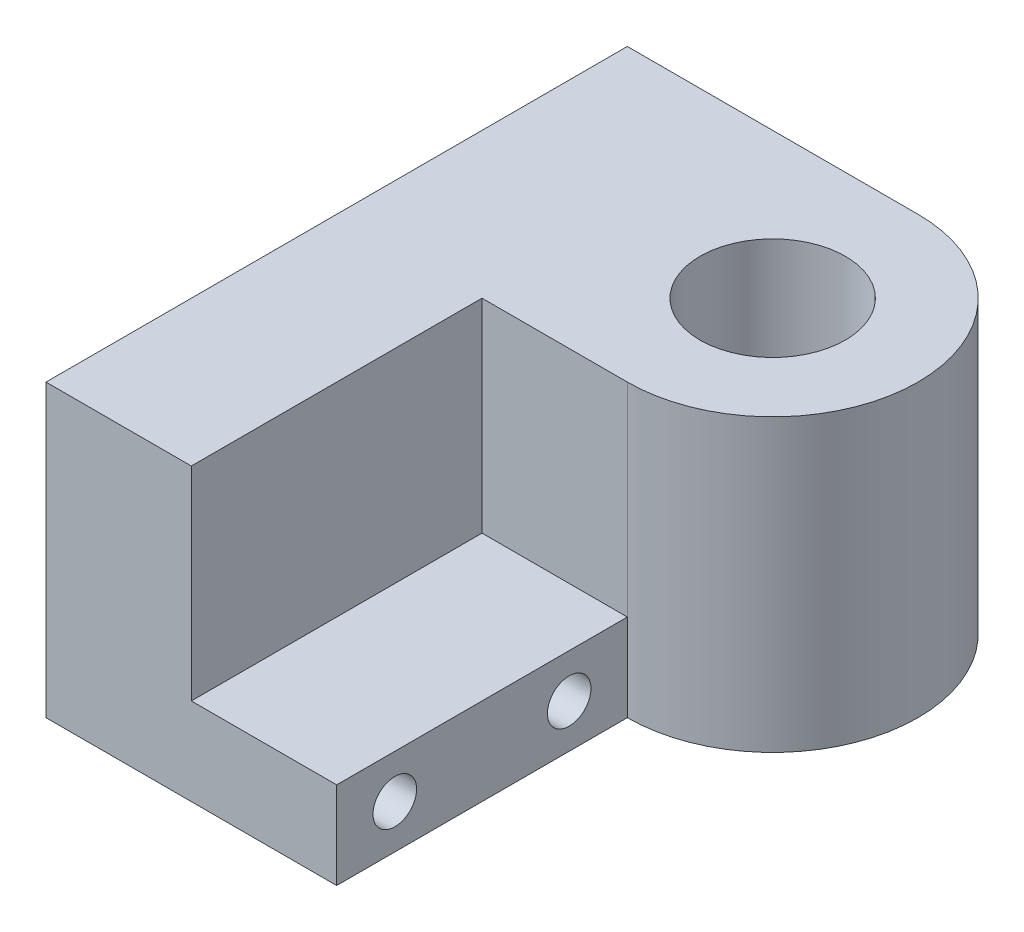
ISO-10303-21;
HEADER;
FILE_DESCRIPTION(('STEP AP214'),'2;1');
FILE_NAME('part.step','',(''),(''),'','','');
FILE_SCHEMA(('AUTOMOTIVE_DESIGN { 1 0 10303 214 1 1 1 1 }'));
ENDSEC;
DATA;
#1=APPLICATION_CONTEXT('core data for automotive mechanical design processes');
#2=APPLICATION_PROTOCOL_DEFINITION('international standard','automotive_design',2000,#1);
#3=PRODUCT_CONTEXT('',#1,'mechanical');
#4=PRODUCT('Part','Part','',(#3));
#5=PRODUCT_RELATED_PRODUCT_CATEGORY('part','',(#4));
#6=PRODUCT_DEFINITION_FORMATION('','',#4);
#7=PRODUCT_DEFINITION_CONTEXT('part definition',#1,'design');
#8=PRODUCT_DEFINITION('design','',#6,#7);
#9=PRODUCT_DEFINITION_SHAPE('','',#8);
#10=(LENGTH_UNIT() NAMED_UNIT(*) SI_UNIT(.MILLI.,.METRE.));
#11=(NAMED_UNIT(*) PLANE_ANGLE_UNIT() SI_UNIT($,.RADIAN.));
#12=(NAMED_UNIT(*) SI_UNIT($,.STERADIAN.) SOLID_ANGLE_UNIT());
#13=UNCERTAINTY_MEASURE_WITH_UNIT(LENGTH_MEASURE(1.E-05),#10,'distance_accuracy_value','');
#14=(GEOMETRIC_REPRESENTATION_CONTEXT(3) GLOBAL_UNCERTAINTY_ASSIGNED_CONTEXT((#13)) GLOBAL_UNIT_ASSIGNED_CONTEXT((#10,
#11,#12)) REPRESENTATION_CONTEXT('',''));
#15=CARTESIAN_POINT('',(0.,0.,0.));
#16=DIRECTION('',(0.,0.,1.));
#17=DIRECTION('',(1.,0.,0.));
#18=AXIS2_PLACEMENT_3D('',#15,#16,#17);
#19=CARTESIAN_POINT('',(0.,100.,50.));
#20=DIRECTION('',(0.,0.,1.));
#21=DIRECTION('',(1.,0.,0.));
#22=AXIS2_PLACEMENT_3D('',#19,#20,#21);
#23=PLANE('',#22);
#24=DIRECTION('',(-1.,0.,0.));
#25=VECTOR('',#24,1.);
#26=CARTESIAN_POINT('',(0.,30.,50.));
#27=LINE('',#26,#25);
#28=CARTESIAN_POINT('',(0.,30.,50.));
#29=VERTEX_POINT('',#28);
#30=CARTESIAN_POINT('',(-50.,30.,50.));
#31=VERTEX_POINT('',#30);
#32=EDGE_CURVE('E50',#29,#31,#27,.T.);
#33=ORIENTED_EDGE('',*,*,#32,.F.);
#34=DIRECTION('',(0.,-1.,0.));
#35=VECTOR('',#34,1.);
#36=CARTESIAN_POINT('',(0.,100.,50.));
#37=LINE('',#36,#35);
#38=CARTESIAN_POINT('',(0.,100.,50.));
#39=VERTEX_POINT('',#38);
#40=EDGE_CURVE('E11',#39,#29,#37,.T.);
#41=ORIENTED_EDGE('',*,*,#40,.F.);
#42=DIRECTION('',(-1.,0.,0.));
#43=VECTOR('',#42,1.);
#44=CARTESIAN_POINT('',(0.,100.,50.));
#45=LINE('',#44,#43);
#46=CARTESIAN_POINT('',(-50.,100.,50.));
#47=VERTEX_POINT('',#46);
#48=EDGE_CURVE('E132',#39,#47,#45,.T.);
#49=ORIENTED_EDGE('',*,*,#48,.T.);
#50=DIRECTION('',(0.,-1.,0.));
#51=VECTOR('',#50,1.);
#52=CARTESIAN_POINT('',(-50.,100.,50.));
#53=LINE('',#52,#51);
#54=EDGE_CURVE('E149',#47,#31,#53,.T.);
#55=ORIENTED_EDGE('',*,*,#54,.T.);
#56=EDGE_LOOP('',(#33,#41,#49,#55));
#57=FACE_BOUND('',#56,.T.);
#58=ADVANCED_FACE('F35',(#57),#23,.T.);
#59=CARTESIAN_POINT('',(0.,100.,0.));
#60=DIRECTION('',(0.,-1.,0.));
#61=DIRECTION('',(0.,0.,-1.));
#62=AXIS2_PLACEMENT_3D('',#59,#60,#61);
#63=CYLINDRICAL_SURFACE('',#62,50.);
#64=CARTESIAN_POINT('',(0.,0.,0.));
#65=DIRECTION('',(0.,1.,0.));
#66=DIRECTION('',(0.,0.,1.));
#67=AXIS2_PLACEMENT_3D('',#64,#65,#66);
#68=CIRCLE('',#67,50.);
#69=CARTESIAN_POINT('',(0.,0.,50.));
#70=VERTEX_POINT('',#69);
#71=CARTESIAN_POINT('',(0.,0.,-50.));
#72=VERTEX_POINT('',#71);
#73=EDGE_CURVE('E152',#70,#72,#68,.T.);
#74=ORIENTED_EDGE('',*,*,#73,.T.);
#75=DIRECTION('',(0.,-1.,0.));
#76=VECTOR('',#75,1.);
#77=CARTESIAN_POINT('',(0.,100.,-50.));
#78=LINE('',#77,#76);
#79=CARTESIAN_POINT('',(0.,100.,-50.));
#80=VERTEX_POINT('',#79);
#81=EDGE_CURVE('E43',#80,#72,#78,.T.);
#82=ORIENTED_EDGE('',*,*,#81,.F.);
#83=CARTESIAN_POINT('',(0.,100.,0.));
#84=DIRECTION('',(0.,1.,0.));
#85=DIRECTION('',(0.,0.,1.));
#86=AXIS2_PLACEMENT_3D('',#83,#84,#85);
#87=CIRCLE('',#86,50.);
#88=EDGE_CURVE('E135',#39,#80,#87,.T.);
#89=ORIENTED_EDGE('',*,*,#88,.F.);
#90=ORIENTED_EDGE('',*,*,#40,.T.);
#91=DIRECTION('',(0.,-1.,0.));
#92=VECTOR('',#91,1.);
#93=CARTESIAN_POINT('',(0.,30.,50.));
#94=LINE('',#93,#92);
#95=EDGE_CURVE('E114',#29,#70,#94,.T.);
#96=ORIENTED_EDGE('',*,*,#95,.T.);
#97=EDGE_LOOP('',(#74,#82,#89,#90,#96));
#98=FACE_BOUND('',#97,.T.);
#99=ADVANCED_FACE('F176',(#98),#63,.T.);
#100=CARTESIAN_POINT('',(0.,100.,-50.));
#101=DIRECTION('',(0.,0.,1.));
#102=DIRECTION('',(1.,0.,0.));
#103=AXIS2_PLACEMENT_3D('',#100,#101,#102);
#104=PLANE('',#103);
#105=DIRECTION('',(-1.,0.,0.));
#106=VECTOR('',#105,1.);
#107=CARTESIAN_POINT('',(0.,0.,-50.));
#108=LINE('',#107,#106);
#109=CARTESIAN_POINT('',(-100.,0.,-50.));
#110=VERTEX_POINT('',#109);
#111=EDGE_CURVE('E155',#72,#110,#108,.T.);
#112=ORIENTED_EDGE('',*,*,#111,.T.);
#113=DIRECTION('',(0.,-1.,0.));
#114=VECTOR('',#113,1.);
#115=CARTESIAN_POINT('',(-100.,100.,-50.));
#116=LINE('',#115,#114);
#117=CARTESIAN_POINT('',(-100.,100.,-50.));
#118=VERTEX_POINT('',#117);
#119=EDGE_CURVE('E166',#118,#110,#116,.T.);
#120=ORIENTED_EDGE('',*,*,#119,.F.);
#121=DIRECTION('',(-1.,0.,0.));
#122=VECTOR('',#121,1.);
#123=CARTESIAN_POINT('',(0.,100.,-50.));
#124=LINE('',#123,#122);
#125=EDGE_CURVE('E138',#80,#118,#124,.T.);
#126=ORIENTED_EDGE('',*,*,#125,.F.);
#127=ORIENTED_EDGE('',*,*,#81,.T.);
#128=EDGE_LOOP('',(#112,#120,#126,#127));
#129=FACE_BOUND('',#128,.T.);
#130=ADVANCED_FACE('F171',(#129),#104,.F.);
#131=CARTESIAN_POINT('',(-100.,100.,0.));
#132=DIRECTION('',(1.,0.,0.));
#133=DIRECTION('',(0.,0.,-1.));
#134=AXIS2_PLACEMENT_3D('',#131,#132,#133);
#135=PLANE('',#134);
#136=CARTESIAN_POINT('',(-100.,15.,70.));
#137=DIRECTION('',(1.,0.,0.));
#138=DIRECTION('',(0.,0.,1.));
#139=AXIS2_PLACEMENT_3D('',#136,#137,#138);
#140=CIRCLE('',#139,7.50000000000001);
#141=CARTESIAN_POINT('',(-100.,15.,77.5));
#142=VERTEX_POINT('',#141);
#143=EDGE_CURVE('E304',#142,#142,#140,.T.);
#144=ORIENTED_EDGE('',*,*,#143,.T.);
#145=EDGE_LOOP('',(#144));
#146=FACE_BOUND('',#145,.T.);
#147=CARTESIAN_POINT('',(-100.,15.,130.));
#148=DIRECTION('',(1.,0.,0.));
#149=DIRECTION('',(0.,0.,-1.));
#150=AXIS2_PLACEMENT_3D('',#147,#148,#149);
#151=CIRCLE('',#150,7.50000000000001);
#152=CARTESIAN_POINT('',(-100.,15.,122.5));
#153=VERTEX_POINT('',#152);
#154=EDGE_CURVE('E120',#153,#153,#151,.T.);
#155=ORIENTED_EDGE('',*,*,#154,.T.);
#156=EDGE_LOOP('',(#155));
#157=FACE_BOUND('',#156,.T.);
#158=DIRECTION('',(0.,0.,1.));
#159=VECTOR('',#158,1.);
#160=CARTESIAN_POINT('',(-100.,0.,0.));
#161=LINE('',#160,#159);
#162=CARTESIAN_POINT('',(-100.,0.,150.));
#163=VERTEX_POINT('',#162);
#164=EDGE_CURVE('E158',#110,#163,#161,.T.);
#165=ORIENTED_EDGE('',*,*,#164,.T.);
#166=DIRECTION('',(0.,-1.,0.));
#167=VECTOR('',#166,1.);
#168=CARTESIAN_POINT('',(-100.,100.,150.));
#169=LINE('',#168,#167);
#170=CARTESIAN_POINT('',(-100.,100.,150.));
#171=VERTEX_POINT('',#170);
#172=EDGE_CURVE('E164',#171,#163,#169,.T.);
#173=ORIENTED_EDGE('',*,*,#172,.F.);
#174=DIRECTION('',(0.,0.,1.));
#175=VECTOR('',#174,1.);
#176=CARTESIAN_POINT('',(-100.,100.,0.));
#177=LINE('',#176,#175);
#178=EDGE_CURVE('E141',#118,#171,#177,.T.);
#179=ORIENTED_EDGE('',*,*,#178,.F.);
#180=ORIENTED_EDGE('',*,*,#119,.T.);
#181=EDGE_LOOP('',(#165,#173,#179,#180));
#182=FACE_BOUND('',#181,.T.);
#183=ADVANCED_FACE('F181',(#146,#157,#182),#135,.F.);
#184=CARTESIAN_POINT('',(0.,100.,150.));
#185=DIRECTION('',(0.,0.,-1.));
#186=DIRECTION('',(-1.,0.,0.));
#187=AXIS2_PLACEMENT_3D('',#184,#185,#186);
#188=PLANE('',#187);
#189=DIRECTION('',(1.,0.,0.));
#190=VECTOR('',#189,1.);
#191=CARTESIAN_POINT('',(0.,0.,150.));
#192=LINE('',#191,#190);
#193=CARTESIAN_POINT('',(0.,0.,150.));
#194=VERTEX_POINT('',#193);
#195=EDGE_CURVE('E110',#163,#194,#192,.T.);
#196=ORIENTED_EDGE('',*,*,#195,.T.);
#197=DIRECTION('',(0.,-1.,0.));
#198=VECTOR('',#197,1.);
#199=CARTESIAN_POINT('',(0.,30.,150.));
#200=LINE('',#199,#198);
#201=CARTESIAN_POINT('',(0.,30.,150.));
#202=VERTEX_POINT('',#201);
#203=EDGE_CURVE('E105',#202,#194,#200,.T.);
#204=ORIENTED_EDGE('',*,*,#203,.F.);
#205=DIRECTION('',(1.,0.,0.));
#206=VECTOR('',#205,1.);
#207=CARTESIAN_POINT('',(0.,30.,150.));
#208=LINE('',#207,#206);
#209=CARTESIAN_POINT('',(-50.,30.,150.));
#210=VERTEX_POINT('',#209);
#211=EDGE_CURVE('E97',#210,#202,#208,.T.);
#212=ORIENTED_EDGE('',*,*,#211,.F.);
#213=DIRECTION('',(0.,-1.,0.));
#214=VECTOR('',#213,1.);
#215=CARTESIAN_POINT('',(-50.,100.,150.));
#216=LINE('',#215,#214);
#217=CARTESIAN_POINT('',(-50.,100.,150.));
#218=VERTEX_POINT('',#217);
#219=EDGE_CURVE('E57',#218,#210,#216,.T.);
#220=ORIENTED_EDGE('',*,*,#219,.F.);
#221=DIRECTION('',(1.,0.,0.));
#222=VECTOR('',#221,1.);
#223=CARTESIAN_POINT('',(0.,100.,150.));
#224=LINE('',#223,#222);
#225=EDGE_CURVE('E144',#171,#218,#224,.T.);
#226=ORIENTED_EDGE('',*,*,#225,.F.);
#227=ORIENTED_EDGE('',*,*,#172,.T.);
#228=EDGE_LOOP('',(#196,#204,#212,#220,#226,#227));
#229=FACE_BOUND('',#228,.T.);
#230=ADVANCED_FACE('F108',(#229),#188,.F.);
#231=CARTESIAN_POINT('',(0.,100.,0.));
#232=DIRECTION('',(0.,-1.,0.));
#233=DIRECTION('',(0.,0.,-1.));
#234=AXIS2_PLACEMENT_3D('',#231,#232,#233);
#235=CYLINDRICAL_SURFACE('',#234,25.);
#236=CARTESIAN_POINT('',(0.,100.,0.));
#237=DIRECTION('',(0.,1.,0.));
#238=DIRECTION('',(0.,0.,1.));
#239=AXIS2_PLACEMENT_3D('',#236,#237,#238);
#240=CIRCLE('',#239,25.);
#241=CARTESIAN_POINT('',(0.,100.,25.));
#242=VERTEX_POINT('',#241);
#243=EDGE_CURVE('E129',#242,#242,#240,.T.);
#244=ORIENTED_EDGE('',*,*,#243,.T.);
#245=EDGE_LOOP('',(#244));
#246=FACE_BOUND('',#245,.T.);
#247=CARTESIAN_POINT('',(0.,0.,0.));
#248=DIRECTION('',(0.,1.,0.));
#249=DIRECTION('',(0.,0.,1.));
#250=AXIS2_PLACEMENT_3D('',#247,#248,#249);
#251=CIRCLE('',#250,25.);
#252=CARTESIAN_POINT('',(0.,0.,25.));
#253=VERTEX_POINT('',#252);
#254=EDGE_CURVE('E128',#253,#253,#251,.T.);
#255=ORIENTED_EDGE('',*,*,#254,.F.);
#256=EDGE_LOOP('',(#255));
#257=FACE_BOUND('',#256,.T.);
#258=ADVANCED_FACE('F37',(#246,#257),#235,.F.);
#259=CARTESIAN_POINT('',(-50.,100.,0.));
#260=DIRECTION('',(-1.,0.,0.));
#261=DIRECTION('',(0.,0.,1.));
#262=AXIS2_PLACEMENT_3D('',#259,#260,#261);
#263=PLANE('',#262);
#264=ORIENTED_EDGE('',*,*,#219,.T.);
#265=DIRECTION('',(0.,0.,-1.));
#266=VECTOR('',#265,1.);
#267=CARTESIAN_POINT('',(-50.,30.,0.));
#268=LINE('',#267,#266);
#269=EDGE_CURVE('E103',#210,#31,#268,.T.);
#270=ORIENTED_EDGE('',*,*,#269,.T.);
#271=ORIENTED_EDGE('',*,*,#54,.F.);
#272=DIRECTION('',(0.,0.,-1.));
#273=VECTOR('',#272,1.);
#274=CARTESIAN_POINT('',(-50.,100.,0.));
#275=LINE('',#274,#273);
#276=EDGE_CURVE('E147',#218,#47,#275,.T.);
#277=ORIENTED_EDGE('',*,*,#276,.F.);
#278=EDGE_LOOP('',(#264,#270,#271,#277));
#279=FACE_BOUND('',#278,.T.);
#280=ADVANCED_FACE('F186',(#279),#263,.F.);
#281=CARTESIAN_POINT('',(0.,100.,0.));
#282=DIRECTION('',(0.,1.,0.));
#283=DIRECTION('',(0.,0.,1.));
#284=AXIS2_PLACEMENT_3D('',#281,#282,#283);
#285=PLANE('',#284);
#286=ORIENTED_EDGE('',*,*,#243,.F.);
#287=EDGE_LOOP('',(#286));
#288=FACE_BOUND('',#287,.T.);
#289=ORIENTED_EDGE('',*,*,#48,.F.);
#290=ORIENTED_EDGE('',*,*,#88,.T.);
#291=ORIENTED_EDGE('',*,*,#125,.T.);
#292=ORIENTED_EDGE('',*,*,#178,.T.);
#293=ORIENTED_EDGE('',*,*,#225,.T.);
#294=ORIENTED_EDGE('',*,*,#276,.T.);
#295=EDGE_LOOP('',(#289,#290,#291,#292,#293,#294));
#296=FACE_BOUND('',#295,.T.);
#297=ADVANCED_FACE('F184',(#288,#296),#285,.T.);
#298=CARTESIAN_POINT('',(0.,0.,0.));
#299=DIRECTION('',(0.,1.,0.));
#300=DIRECTION('',(0.,0.,1.));
#301=AXIS2_PLACEMENT_3D('',#298,#299,#300);
#302=PLANE('',#301);
#303=ORIENTED_EDGE('',*,*,#254,.T.);
#304=EDGE_LOOP('',(#303));
#305=FACE_BOUND('',#304,.T.);
#306=ORIENTED_EDGE('',*,*,#73,.F.);
#307=DIRECTION('',(0.,0.,-1.));
#308=VECTOR('',#307,1.);
#309=CARTESIAN_POINT('',(0.,0.,0.));
#310=LINE('',#309,#308);
#311=EDGE_CURVE('E117',#194,#70,#310,.T.);
#312=ORIENTED_EDGE('',*,*,#311,.F.);
#313=ORIENTED_EDGE('',*,*,#195,.F.);
#314=ORIENTED_EDGE('',*,*,#164,.F.);
#315=ORIENTED_EDGE('',*,*,#111,.F.);
#316=EDGE_LOOP('',(#306,#312,#313,#314,#315));
#317=FACE_BOUND('',#316,.T.);
#318=ADVANCED_FACE('F178',(#305,#317),#302,.F.);
#319=CARTESIAN_POINT('',(0.,30.,0.));
#320=DIRECTION('',(-1.,0.,0.));
#321=DIRECTION('',(0.,0.,1.));
#322=AXIS2_PLACEMENT_3D('',#319,#320,#321);
#323=PLANE('',#322);
#324=CARTESIAN_POINT('',(0.,15.,70.));
#325=DIRECTION('',(1.,0.,0.));
#326=DIRECTION('',(0.,0.,1.));
#327=AXIS2_PLACEMENT_3D('',#324,#325,#326);
#328=CIRCLE('',#327,7.50000000000001);
#329=CARTESIAN_POINT('',(0.,15.,77.5));
#330=VERTEX_POINT('',#329);
#331=EDGE_CURVE('E307',#330,#330,#328,.T.);
#332=ORIENTED_EDGE('',*,*,#331,.F.);
#333=EDGE_LOOP('',(#332));
#334=FACE_BOUND('',#333,.T.);
#335=CARTESIAN_POINT('',(0.,15.,130.));
#336=DIRECTION('',(1.,0.,0.));
#337=DIRECTION('',(0.,0.,-1.));
#338=AXIS2_PLACEMENT_3D('',#335,#336,#337);
#339=CIRCLE('',#338,7.50000000000001);
#340=CARTESIAN_POINT('',(0.,15.,122.5));
#341=VERTEX_POINT('',#340);
#342=EDGE_CURVE('E123',#341,#341,#339,.T.);
#343=ORIENTED_EDGE('',*,*,#342,.F.);
#344=EDGE_LOOP('',(#343));
#345=FACE_BOUND('',#344,.T.);
#346=ORIENTED_EDGE('',*,*,#311,.T.);
#347=ORIENTED_EDGE('',*,*,#95,.F.);
#348=DIRECTION('',(0.,0.,-1.));
#349=VECTOR('',#348,1.);
#350=CARTESIAN_POINT('',(0.,30.,0.));
#351=LINE('',#350,#349);
#352=EDGE_CURVE('E101',#202,#29,#351,.T.);
#353=ORIENTED_EDGE('',*,*,#352,.F.);
#354=ORIENTED_EDGE('',*,*,#203,.T.);
#355=EDGE_LOOP('',(#346,#347,#353,#354));
#356=FACE_BOUND('',#355,.T.);
#357=ADVANCED_FACE('F116',(#334,#345,#356),#323,.F.);
#358=CARTESIAN_POINT('',(0.,30.,0.));
#359=DIRECTION('',(0.,1.,0.));
#360=DIRECTION('',(0.,0.,1.));
#361=AXIS2_PLACEMENT_3D('',#358,#359,#360);
#362=PLANE('',#361);
#363=ORIENTED_EDGE('',*,*,#352,.T.);
#364=ORIENTED_EDGE('',*,*,#32,.T.);
#365=ORIENTED_EDGE('',*,*,#269,.F.);
#366=ORIENTED_EDGE('',*,*,#211,.T.);
#367=EDGE_LOOP('',(#363,#364,#365,#366));
#368=FACE_BOUND('',#367,.T.);
#369=ADVANCED_FACE('F99',(#368),#362,.T.);
#370=CARTESIAN_POINT('',(-100.,15.,130.));
#371=DIRECTION('',(1.,0.,0.));
#372=DIRECTION('',(0.,0.,-1.));
#373=AXIS2_PLACEMENT_3D('',#370,#371,#372);
#374=CYLINDRICAL_SURFACE('',#373,7.50000000000001);
#375=ORIENTED_EDGE('',*,*,#154,.F.);
#376=EDGE_LOOP('',(#375));
#377=FACE_BOUND('',#376,.T.);
#378=ORIENTED_EDGE('',*,*,#342,.T.);
#379=EDGE_LOOP('',(#378));
#380=FACE_BOUND('',#379,.T.);
#381=ADVANCED_FACE('F278',(#377,#380),#374,.F.);
#382=CARTESIAN_POINT('',(-100.,15.,70.));
#383=DIRECTION('',(1.,0.,0.));
#384=DIRECTION('',(0.,0.,-1.));
#385=AXIS2_PLACEMENT_3D('',#382,#383,#384);
#386=CYLINDRICAL_SURFACE('',#385,7.50000000000001);
#387=ORIENTED_EDGE('',*,*,#143,.F.);
#388=EDGE_LOOP('',(#387));
#389=FACE_BOUND('',#388,.T.);
#390=ORIENTED_EDGE('',*,*,#331,.T.);
#391=EDGE_LOOP('',(#390));
#392=FACE_BOUND('',#391,.T.);
#393=ADVANCED_FACE('F285',(#389,#392),#386,.F.);
#394=CLOSED_SHELL('',(#58,#99,#130,#183,#230,#258,#280,#297,#318,#357,#369,#381,#393));
#395=MANIFOLD_SOLID_BREP('B2',#394);
#396=ADVANCED_BREP_SHAPE_REPRESENTATION('',(#18,#395),#14);
#397=SHAPE_DEFINITION_REPRESENTATION(#9,#396);
ENDSEC;
END-ISO-10303-21;
